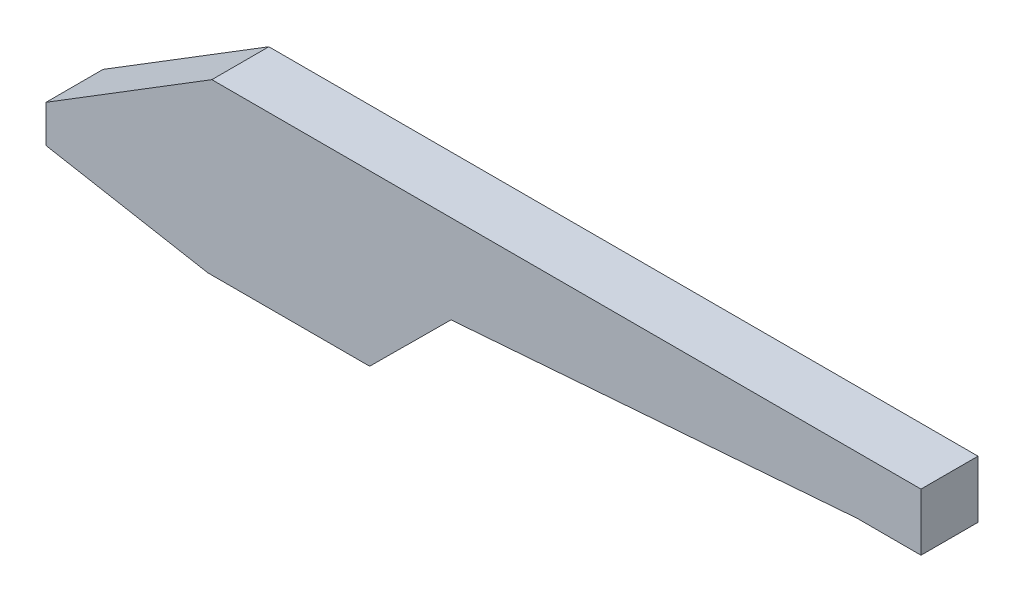
ISO-10303-21;
HEADER;
FILE_DESCRIPTION(('STEP AP214'),'2;1');
FILE_NAME('part.step','',(''),(''),'','','');
FILE_SCHEMA(('AUTOMOTIVE_DESIGN { 1 0 10303 214 1 1 1 1 }'));
ENDSEC;
DATA;
#1=APPLICATION_CONTEXT('core data for automotive mechanical design processes');
#2=APPLICATION_PROTOCOL_DEFINITION('international standard','automotive_design',2000,#1);
#3=PRODUCT_CONTEXT('',#1,'mechanical');
#4=PRODUCT('Part','Part','',(#3));
#5=PRODUCT_RELATED_PRODUCT_CATEGORY('part','',(#4));
#6=PRODUCT_DEFINITION_FORMATION('','',#4);
#7=PRODUCT_DEFINITION_CONTEXT('part definition',#1,'design');
#8=PRODUCT_DEFINITION('design','',#6,#7);
#9=PRODUCT_DEFINITION_SHAPE('','',#8);
#10=(LENGTH_UNIT() NAMED_UNIT(*) SI_UNIT(.MILLI.,.METRE.));
#11=(NAMED_UNIT(*) PLANE_ANGLE_UNIT() SI_UNIT($,.RADIAN.));
#12=(NAMED_UNIT(*) SI_UNIT($,.STERADIAN.) SOLID_ANGLE_UNIT());
#13=UNCERTAINTY_MEASURE_WITH_UNIT(LENGTH_MEASURE(1.E-05),#10,'distance_accuracy_value','');
#14=(GEOMETRIC_REPRESENTATION_CONTEXT(3) GLOBAL_UNCERTAINTY_ASSIGNED_CONTEXT((#13)) GLOBAL_UNIT_ASSIGNED_CONTEXT((#10,
#11,#12)) REPRESENTATION_CONTEXT('',''));
#15=CARTESIAN_POINT('',(0.,0.,0.));
#16=DIRECTION('',(0.,0.,1.));
#17=DIRECTION('',(1.,0.,0.));
#18=AXIS2_PLACEMENT_3D('',#15,#16,#17);
#19=CARTESIAN_POINT('',(576.530281573478,118.813515450902,40.));
#20=DIRECTION('',(0.,-1.,0.));
#21=DIRECTION('',(0.,0.,-1.));
#22=AXIS2_PLACEMENT_3D('',#19,#20,#21);
#23=PLANE('',#22);
#24=DIRECTION('',(-1.,0.,0.));
#25=VECTOR('',#24,1.);
#26=CARTESIAN_POINT('',(576.530281573478,118.813515450902,-40.));
#27=LINE('',#26,#25);
#28=CARTESIAN_POINT('',(614.016581357167,118.813515450902,-40.));
#29=VERTEX_POINT('',#28);
#30=CARTESIAN_POINT('',(-381.24605125982,118.813515450902,-40.));
#31=VERTEX_POINT('',#30);
#32=EDGE_CURVE('E95',#29,#31,#27,.T.);
#33=ORIENTED_EDGE('',*,*,#32,.T.);
#34=DIRECTION('',(0.,0.,-1.));
#35=VECTOR('',#34,1.);
#36=CARTESIAN_POINT('',(-381.24605125982,118.813515450902,40.));
#37=LINE('',#36,#35);
#38=CARTESIAN_POINT('',(-381.24605125982,118.813515450902,40.));
#39=VERTEX_POINT('',#38);
#40=EDGE_CURVE('E11',#39,#31,#37,.T.);
#41=ORIENTED_EDGE('',*,*,#40,.F.);
#42=DIRECTION('',(-1.,0.,0.));
#43=VECTOR('',#42,1.);
#44=CARTESIAN_POINT('',(576.530281573478,118.813515450902,40.));
#45=LINE('',#44,#43);
#46=CARTESIAN_POINT('',(614.016581357167,118.813515450902,40.));
#47=VERTEX_POINT('',#46);
#48=EDGE_CURVE('E101',#47,#39,#45,.T.);
#49=ORIENTED_EDGE('',*,*,#48,.F.);
#50=DIRECTION('',(0.,0.,-1.));
#51=VECTOR('',#50,1.);
#52=CARTESIAN_POINT('',(614.016581357167,118.813515450902,40.));
#53=LINE('',#52,#51);
#54=EDGE_CURVE('E142',#47,#29,#53,.T.);
#55=ORIENTED_EDGE('',*,*,#54,.T.);
#56=EDGE_LOOP('',(#33,#41,#49,#55));
#57=FACE_BOUND('',#56,.T.);
#58=ADVANCED_FACE('F39',(#57),#23,.F.);
#59=CARTESIAN_POINT('',(-614.016581357167,-25.1061072567448,40.));
#60=DIRECTION('',(0.525888488707099,-0.850553524150811,0.));
#61=DIRECTION('',(0.850553524150811,0.525888488707099,0.));
#62=AXIS2_PLACEMENT_3D('',#59,#60,#61);
#63=PLANE('',#62);
#64=DIRECTION('',(-0.850553524150811,-0.525888488707099,0.));
#65=VECTOR('',#64,1.);
#66=CARTESIAN_POINT('',(-614.016581357167,-25.1061072567448,-40.));
#67=LINE('',#66,#65);
#68=CARTESIAN_POINT('',(-614.016581357167,-25.1061072567448,-40.));
#69=VERTEX_POINT('',#68);
#70=EDGE_CURVE('E148',#31,#69,#67,.T.);
#71=ORIENTED_EDGE('',*,*,#70,.T.);
#72=DIRECTION('',(0.,0.,-1.));
#73=VECTOR('',#72,1.);
#74=CARTESIAN_POINT('',(-614.016581357167,-25.1061072567448,40.));
#75=LINE('',#74,#73);
#76=CARTESIAN_POINT('',(-614.016581357167,-25.1061072567448,40.));
#77=VERTEX_POINT('',#76);
#78=EDGE_CURVE('E48',#77,#69,#75,.T.);
#79=ORIENTED_EDGE('',*,*,#78,.F.);
#80=DIRECTION('',(-0.850553524150811,-0.525888488707099,0.));
#81=VECTOR('',#80,1.);
#82=CARTESIAN_POINT('',(-614.016581357167,-25.1061072567448,40.));
#83=LINE('',#82,#81);
#84=EDGE_CURVE('E221',#39,#77,#83,.T.);
#85=ORIENTED_EDGE('',*,*,#84,.F.);
#86=ORIENTED_EDGE('',*,*,#40,.T.);
#87=EDGE_LOOP('',(#71,#79,#85,#86));
#88=FACE_BOUND('',#87,.T.);
#89=ADVANCED_FACE('F225',(#88),#63,.F.);
#90=CARTESIAN_POINT('',(-614.016581357167,-77.6682231474961,40.));
#91=DIRECTION('',(1.,0.,0.));
#92=DIRECTION('',(0.,0.,-1.));
#93=AXIS2_PLACEMENT_3D('',#90,#91,#92);
#94=PLANE('',#93);
#95=DIRECTION('',(0.,-1.,0.));
#96=VECTOR('',#95,1.);
#97=CARTESIAN_POINT('',(-614.016581357167,-77.6682231474961,-40.));
#98=LINE('',#97,#96);
#99=CARTESIAN_POINT('',(-614.016581357167,-77.6682231474961,-40.));
#100=VERTEX_POINT('',#99);
#101=EDGE_CURVE('E151',#69,#100,#98,.T.);
#102=ORIENTED_EDGE('',*,*,#101,.T.);
#103=DIRECTION('',(0.,0.,-1.));
#104=VECTOR('',#103,1.);
#105=CARTESIAN_POINT('',(-614.016581357167,-77.6682231474961,40.));
#106=LINE('',#105,#104);
#107=CARTESIAN_POINT('',(-614.016581357167,-77.6682231474961,40.));
#108=VERTEX_POINT('',#107);
#109=EDGE_CURVE('E185',#108,#100,#106,.T.);
#110=ORIENTED_EDGE('',*,*,#109,.F.);
#111=DIRECTION('',(0.,-1.,0.));
#112=VECTOR('',#111,1.);
#113=CARTESIAN_POINT('',(-614.016581357167,-77.6682231474961,40.));
#114=LINE('',#113,#112);
#115=EDGE_CURVE('E196',#77,#108,#114,.T.);
#116=ORIENTED_EDGE('',*,*,#115,.F.);
#117=ORIENTED_EDGE('',*,*,#78,.T.);
#118=EDGE_LOOP('',(#102,#110,#116,#117));
#119=FACE_BOUND('',#118,.T.);
#120=ADVANCED_FACE('F194',(#119),#94,.F.);
#121=CARTESIAN_POINT('',(-386.909457622119,-118.813515450902,40.));
#122=DIRECTION('',(0.178269249580368,0.983981745081713,0.));
#123=DIRECTION('',(-0.983981745081713,0.178269249580368,0.));
#124=AXIS2_PLACEMENT_3D('',#121,#122,#123);
#125=PLANE('',#124);
#126=DIRECTION('',(0.983981745081713,-0.178269249580368,0.));
#127=VECTOR('',#126,1.);
#128=CARTESIAN_POINT('',(-386.909457622119,-118.813515450902,-40.));
#129=LINE('',#128,#127);
#130=CARTESIAN_POINT('',(-386.909457622119,-118.813515450902,-40.));
#131=VERTEX_POINT('',#130);
#132=EDGE_CURVE('E154',#100,#131,#129,.T.);
#133=ORIENTED_EDGE('',*,*,#132,.T.);
#134=DIRECTION('',(0.,0.,-1.));
#135=VECTOR('',#134,1.);
#136=CARTESIAN_POINT('',(-386.909457622119,-118.813515450902,40.));
#137=LINE('',#136,#135);
#138=CARTESIAN_POINT('',(-386.909457622119,-118.813515450902,40.));
#139=VERTEX_POINT('',#138);
#140=EDGE_CURVE('E181',#139,#131,#137,.T.);
#141=ORIENTED_EDGE('',*,*,#140,.F.);
#142=DIRECTION('',(0.983981745081713,-0.178269249580368,0.));
#143=VECTOR('',#142,1.);
#144=CARTESIAN_POINT('',(-386.909457622119,-118.813515450902,40.));
#145=LINE('',#144,#143);
#146=EDGE_CURVE('E213',#108,#139,#145,.T.);
#147=ORIENTED_EDGE('',*,*,#146,.F.);
#148=ORIENTED_EDGE('',*,*,#109,.T.);
#149=EDGE_LOOP('',(#133,#141,#147,#148));
#150=FACE_BOUND('',#149,.T.);
#151=ADVANCED_FACE('F205',(#150),#125,.F.);
#152=CARTESIAN_POINT('',(-159.802333887071,-118.813515450902,40.));
#153=DIRECTION('',(0.,1.,0.));
#154=DIRECTION('',(0.,0.,1.));
#155=AXIS2_PLACEMENT_3D('',#152,#153,#154);
#156=PLANE('',#155);
#157=DIRECTION('',(1.,0.,0.));
#158=VECTOR('',#157,1.);
#159=CARTESIAN_POINT('',(-159.802333887071,-118.813515450902,-40.));
#160=LINE('',#159,#158);
#161=CARTESIAN_POINT('',(-159.802333887071,-118.813515450902,-40.));
#162=VERTEX_POINT('',#161);
#163=EDGE_CURVE('E157',#131,#162,#160,.T.);
#164=ORIENTED_EDGE('',*,*,#163,.T.);
#165=DIRECTION('',(0.,0.,-1.));
#166=VECTOR('',#165,1.);
#167=CARTESIAN_POINT('',(-159.802333887071,-118.813515450902,40.));
#168=LINE('',#167,#166);
#169=CARTESIAN_POINT('',(-159.802333887071,-118.813515450902,40.));
#170=VERTEX_POINT('',#169);
#171=EDGE_CURVE('E177',#170,#162,#168,.T.);
#172=ORIENTED_EDGE('',*,*,#171,.F.);
#173=DIRECTION('',(1.,0.,0.));
#174=VECTOR('',#173,1.);
#175=CARTESIAN_POINT('',(-159.802333887071,-118.813515450902,40.));
#176=LINE('',#175,#174);
#177=EDGE_CURVE('E211',#139,#170,#176,.T.);
#178=ORIENTED_EDGE('',*,*,#177,.F.);
#179=ORIENTED_EDGE('',*,*,#140,.T.);
#180=EDGE_LOOP('',(#164,#172,#178,#179));
#181=FACE_BOUND('',#180,.T.);
#182=ADVANCED_FACE('F209',(#181),#156,.F.);
#183=CARTESIAN_POINT('',(-45.5744066161904,-5.33549348207146,40.));
#184=DIRECTION('',(-0.704774240457035,0.709431652795539,0.));
#185=DIRECTION('',(-0.709431652795539,-0.704774240457035,0.));
#186=AXIS2_PLACEMENT_3D('',#183,#184,#185);
#187=PLANE('',#186);
#188=DIRECTION('',(0.709431652795539,0.704774240457035,0.));
#189=VECTOR('',#188,1.);
#190=CARTESIAN_POINT('',(-45.5744066161904,-5.33549348207146,-40.));
#191=LINE('',#190,#189);
#192=CARTESIAN_POINT('',(-45.5744066161904,-5.33549348207146,-40.));
#193=VERTEX_POINT('',#192);
#194=EDGE_CURVE('E160',#162,#193,#191,.T.);
#195=ORIENTED_EDGE('',*,*,#194,.T.);
#196=DIRECTION('',(0.,0.,-1.));
#197=VECTOR('',#196,1.);
#198=CARTESIAN_POINT('',(-45.5744066161904,-5.33549348207146,40.));
#199=LINE('',#198,#197);
#200=CARTESIAN_POINT('',(-45.5744066161904,-5.33549348207146,40.));
#201=VERTEX_POINT('',#200);
#202=EDGE_CURVE('E135',#201,#193,#199,.T.);
#203=ORIENTED_EDGE('',*,*,#202,.F.);
#204=DIRECTION('',(0.709431652795539,0.704774240457035,0.));
#205=VECTOR('',#204,1.);
#206=CARTESIAN_POINT('',(-45.5744066161904,-5.33549348207146,40.));
#207=LINE('',#206,#205);
#208=EDGE_CURVE('E124',#170,#201,#207,.T.);
#209=ORIENTED_EDGE('',*,*,#208,.F.);
#210=ORIENTED_EDGE('',*,*,#171,.T.);
#211=EDGE_LOOP('',(#195,#203,#209,#210));
#212=FACE_BOUND('',#211,.T.);
#213=ADVANCED_FACE('F230',(#212),#187,.F.);
#214=CARTESIAN_POINT('',(524.577232755159,38.4839345336863,40.));
#215=DIRECTION('',(-0.0766297579540014,0.997059617172369,0.));
#216=DIRECTION('',(-0.997059617172369,-0.0766297579540014,0.));
#217=AXIS2_PLACEMENT_3D('',#214,#215,#216);
#218=PLANE('',#217);
#219=DIRECTION('',(0.997059617172369,0.0766297579540014,0.));
#220=VECTOR('',#219,1.);
#221=CARTESIAN_POINT('',(524.577232755159,38.4839345336863,-40.));
#222=LINE('',#221,#220);
#223=CARTESIAN_POINT('',(524.577232755159,38.4839345336863,-40.));
#224=VERTEX_POINT('',#223);
#225=EDGE_CURVE('E133',#193,#224,#222,.T.);
#226=ORIENTED_EDGE('',*,*,#225,.T.);
#227=DIRECTION('',(0.,0.,-1.));
#228=VECTOR('',#227,1.);
#229=CARTESIAN_POINT('',(524.577232755159,38.4839345336863,40.));
#230=LINE('',#229,#228);
#231=CARTESIAN_POINT('',(524.577232755159,38.4839345336863,40.));
#232=VERTEX_POINT('',#231);
#233=EDGE_CURVE('E130',#232,#224,#230,.T.);
#234=ORIENTED_EDGE('',*,*,#233,.F.);
#235=DIRECTION('',(0.997059617172369,0.0766297579540014,0.));
#236=VECTOR('',#235,1.);
#237=CARTESIAN_POINT('',(524.577232755159,38.4839345336863,40.));
#238=LINE('',#237,#236);
#239=EDGE_CURVE('E118',#201,#232,#238,.T.);
#240=ORIENTED_EDGE('',*,*,#239,.F.);
#241=ORIENTED_EDGE('',*,*,#202,.T.);
#242=EDGE_LOOP('',(#226,#234,#240,#241));
#243=FACE_BOUND('',#242,.T.);
#244=ADVANCED_FACE('F131',(#243),#218,.F.);
#245=CARTESIAN_POINT('',(614.016581357167,38.3698435611472,40.));
#246=DIRECTION('',(0.00127562288296081,0.999999186392799,0.));
#247=DIRECTION('',(-0.999999186392799,0.00127562288296081,0.));
#248=AXIS2_PLACEMENT_3D('',#245,#246,#247);
#249=PLANE('',#248);
#250=DIRECTION('',(0.999999186392799,-0.00127562288296081,0.));
#251=VECTOR('',#250,1.);
#252=CARTESIAN_POINT('',(614.016581357167,38.3698435611472,-40.));
#253=LINE('',#252,#251);
#254=CARTESIAN_POINT('',(614.016581357167,38.3698435611472,-40.));
#255=VERTEX_POINT('',#254);
#256=EDGE_CURVE('E88',#224,#255,#253,.T.);
#257=ORIENTED_EDGE('',*,*,#256,.T.);
#258=DIRECTION('',(0.,0.,-1.));
#259=VECTOR('',#258,1.);
#260=CARTESIAN_POINT('',(614.016581357167,38.3698435611472,40.));
#261=LINE('',#260,#259);
#262=CARTESIAN_POINT('',(614.016581357167,38.3698435611472,40.));
#263=VERTEX_POINT('',#262);
#264=EDGE_CURVE('E136',#263,#255,#261,.T.);
#265=ORIENTED_EDGE('',*,*,#264,.F.);
#266=DIRECTION('',(0.999999186392799,-0.00127562288296081,0.));
#267=VECTOR('',#266,1.);
#268=CARTESIAN_POINT('',(614.016581357167,38.3698435611472,40.));
#269=LINE('',#268,#267);
#270=EDGE_CURVE('E122',#232,#263,#269,.T.);
#271=ORIENTED_EDGE('',*,*,#270,.F.);
#272=ORIENTED_EDGE('',*,*,#233,.T.);
#273=EDGE_LOOP('',(#257,#265,#271,#272));
#274=FACE_BOUND('',#273,.T.);
#275=ADVANCED_FACE('F138',(#274),#249,.F.);
#276=CARTESIAN_POINT('',(614.016581357167,118.813515450902,40.));
#277=DIRECTION('',(-1.,0.,0.));
#278=DIRECTION('',(0.,0.,1.));
#279=AXIS2_PLACEMENT_3D('',#276,#277,#278);
#280=PLANE('',#279);
#281=DIRECTION('',(0.,1.,0.));
#282=VECTOR('',#281,1.);
#283=CARTESIAN_POINT('',(614.016581357167,118.813515450902,-40.));
#284=LINE('',#283,#282);
#285=EDGE_CURVE('E167',#255,#29,#284,.T.);
#286=ORIENTED_EDGE('',*,*,#285,.T.);
#287=ORIENTED_EDGE('',*,*,#54,.F.);
#288=DIRECTION('',(0.,1.,0.));
#289=VECTOR('',#288,1.);
#290=CARTESIAN_POINT('',(614.016581357167,118.813515450902,40.));
#291=LINE('',#290,#289);
#292=EDGE_CURVE('E56',#263,#47,#291,.T.);
#293=ORIENTED_EDGE('',*,*,#292,.F.);
#294=ORIENTED_EDGE('',*,*,#264,.T.);
#295=EDGE_LOOP('',(#286,#287,#293,#294));
#296=FACE_BOUND('',#295,.T.);
#297=ADVANCED_FACE('F228',(#296),#280,.F.);
#298=CARTESIAN_POINT('',(0.,0.,40.));
#299=DIRECTION('',(0.,0.,-1.));
#300=DIRECTION('',(-1.,0.,0.));
#301=AXIS2_PLACEMENT_3D('',#298,#299,#300);
#302=PLANE('',#301);
#303=ORIENTED_EDGE('',*,*,#48,.T.);
#304=ORIENTED_EDGE('',*,*,#84,.T.);
#305=ORIENTED_EDGE('',*,*,#115,.T.);
#306=ORIENTED_EDGE('',*,*,#146,.T.);
#307=ORIENTED_EDGE('',*,*,#177,.T.);
#308=ORIENTED_EDGE('',*,*,#208,.T.);
#309=ORIENTED_EDGE('',*,*,#239,.T.);
#310=ORIENTED_EDGE('',*,*,#270,.T.);
#311=ORIENTED_EDGE('',*,*,#292,.T.);
#312=EDGE_LOOP('',(#303,#304,#305,#306,#307,#308,#309,#310,#311));
#313=FACE_BOUND('',#312,.T.);
#314=ADVANCED_FACE('F120',(#313),#302,.F.);
#315=CARTESIAN_POINT('',(0.,0.,-40.));
#316=DIRECTION('',(0.,0.,-1.));
#317=DIRECTION('',(-1.,0.,0.));
#318=AXIS2_PLACEMENT_3D('',#315,#316,#317);
#319=PLANE('',#318);
#320=ORIENTED_EDGE('',*,*,#32,.F.);
#321=ORIENTED_EDGE('',*,*,#285,.F.);
#322=ORIENTED_EDGE('',*,*,#256,.F.);
#323=ORIENTED_EDGE('',*,*,#225,.F.);
#324=ORIENTED_EDGE('',*,*,#194,.F.);
#325=ORIENTED_EDGE('',*,*,#163,.F.);
#326=ORIENTED_EDGE('',*,*,#132,.F.);
#327=ORIENTED_EDGE('',*,*,#101,.F.);
#328=ORIENTED_EDGE('',*,*,#70,.F.);
#329=EDGE_LOOP('',(#320,#321,#322,#323,#324,#325,#326,#327,#328));
#330=FACE_BOUND('',#329,.T.);
#331=ADVANCED_FACE('F200',(#330),#319,.T.);
#332=CLOSED_SHELL('',(#58,#89,#120,#151,#182,#213,#244,#275,#297,#314,#331));
#333=MANIFOLD_SOLID_BREP('B2',#332);
#334=ADVANCED_BREP_SHAPE_REPRESENTATION('',(#18,#333),#14);
#335=SHAPE_DEFINITION_REPRESENTATION(#9,#334);
ENDSEC;
END-ISO-10303-21;
